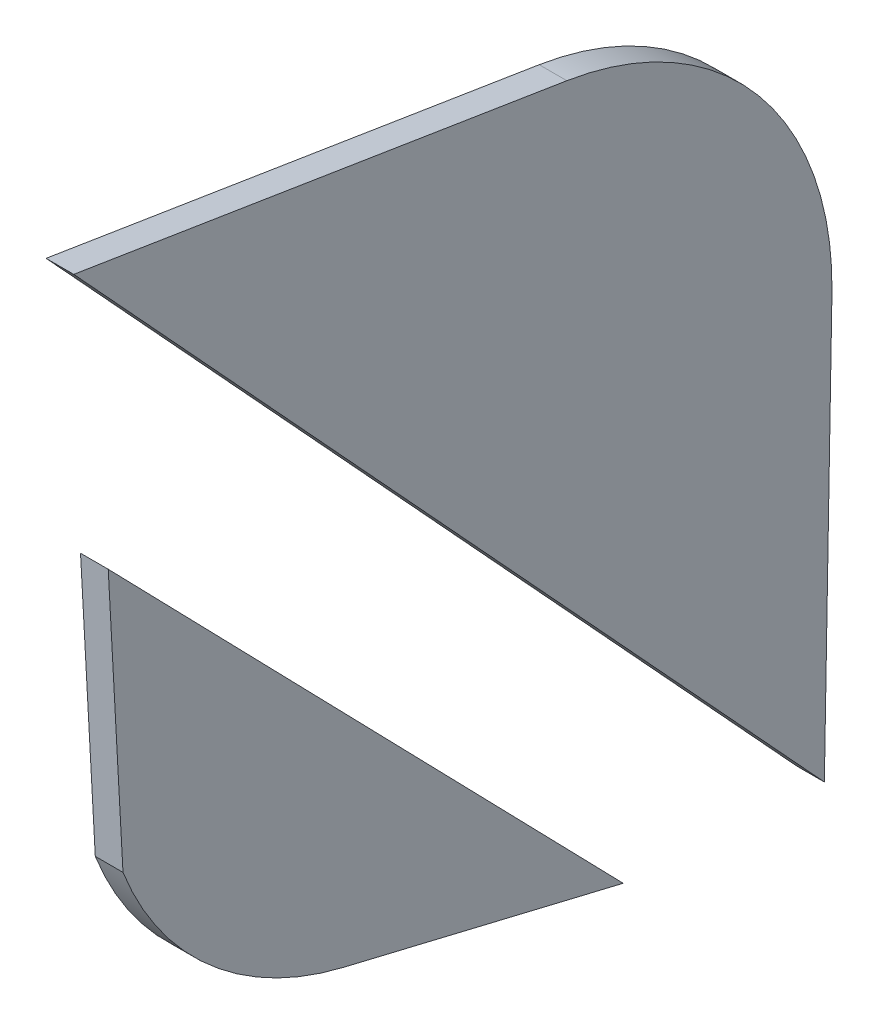
ISO-10303-21;
HEADER;
FILE_DESCRIPTION(('STEP AP214'),'2;1');
FILE_NAME('part.step','',(''),(''),'','','');
FILE_SCHEMA(('AUTOMOTIVE_DESIGN { 1 0 10303 214 1 1 1 1 }'));
ENDSEC;
DATA;
#1=APPLICATION_CONTEXT('core data for automotive mechanical design processes');
#2=APPLICATION_PROTOCOL_DEFINITION('international standard','automotive_design',2000,#1);
#3=PRODUCT_CONTEXT('',#1,'mechanical');
#4=PRODUCT('Part','Part','',(#3));
#5=PRODUCT_RELATED_PRODUCT_CATEGORY('part','',(#4));
#6=PRODUCT_DEFINITION_FORMATION('','',#4);
#7=PRODUCT_DEFINITION_CONTEXT('part definition',#1,'design');
#8=PRODUCT_DEFINITION('design','',#6,#7);
#9=PRODUCT_DEFINITION_SHAPE('','',#8);
#10=(LENGTH_UNIT() NAMED_UNIT(*) SI_UNIT(.MILLI.,.METRE.));
#11=(NAMED_UNIT(*) PLANE_ANGLE_UNIT() SI_UNIT($,.RADIAN.));
#12=(NAMED_UNIT(*) SI_UNIT($,.STERADIAN.) SOLID_ANGLE_UNIT());
#13=UNCERTAINTY_MEASURE_WITH_UNIT(LENGTH_MEASURE(1.E-05),#10,'distance_accuracy_value','');
#14=(GEOMETRIC_REPRESENTATION_CONTEXT(3) GLOBAL_UNCERTAINTY_ASSIGNED_CONTEXT((#13)) GLOBAL_UNIT_ASSIGNED_CONTEXT((#10,
#11,#12)) REPRESENTATION_CONTEXT('',''));
#15=CARTESIAN_POINT('',(0.,0.,0.));
#16=DIRECTION('',(0.,0.,1.));
#17=DIRECTION('',(1.,0.,0.));
#18=AXIS2_PLACEMENT_3D('',#15,#16,#17);
#19=CARTESIAN_POINT('',(3.,30.4101255650736,1.66494493144792));
#20=DIRECTION('',(-1.,0.,0.));
#21=DIRECTION('',(0.,0.,1.));
#22=AXIS2_PLACEMENT_3D('',#19,#20,#21);
#23=CYLINDRICAL_SURFACE('',#22,34.0995000000001);
#24=CARTESIAN_POINT('',(0.,30.4101255650736,1.66494493144792));
#25=DIRECTION('',(1.,0.,0.));
#26=DIRECTION('',(0.,0.,-1.));
#27=AXIS2_PLACEMENT_3D('',#24,#25,#26);
#28=CIRCLE('',#27,34.0995000000001);
#29=CARTESIAN_POINT('',(0.,18.0941682146981,33.4626350172661));
#30=VERTEX_POINT('',#29);
#31=CARTESIAN_POINT('',(0.,-2.74986062470444,9.61423522327529));
#32=VERTEX_POINT('',#31);
#33=EDGE_CURVE('E106',#30,#32,#28,.T.);
#34=ORIENTED_EDGE('',*,*,#33,.T.);
#35=DIRECTION('',(-1.,0.,0.));
#36=VECTOR('',#35,1.);
#37=CARTESIAN_POINT('',(3.,-2.74986062470444,9.61423522327529));
#38=LINE('',#37,#36);
#39=CARTESIAN_POINT('',(3.,-2.74986062470444,9.61423522327529));
#40=VERTEX_POINT('',#39);
#41=EDGE_CURVE('E12',#40,#32,#38,.T.);
#42=ORIENTED_EDGE('',*,*,#41,.F.);
#43=CARTESIAN_POINT('',(3.,30.4101255650736,1.66494493144792));
#44=DIRECTION('',(1.,0.,0.));
#45=DIRECTION('',(0.,0.,-1.));
#46=AXIS2_PLACEMENT_3D('',#43,#44,#45);
#47=CIRCLE('',#46,34.0995000000001);
#48=CARTESIAN_POINT('',(3.,18.0941682146981,33.4626350172661));
#49=VERTEX_POINT('',#48);
#50=EDGE_CURVE('E94',#49,#40,#47,.T.);
#51=ORIENTED_EDGE('',*,*,#50,.F.);
#52=DIRECTION('',(-1.,0.,0.));
#53=VECTOR('',#52,1.);
#54=CARTESIAN_POINT('',(3.,18.0941682146981,33.4626350172661));
#55=LINE('',#54,#53);
#56=EDGE_CURVE('E102',#49,#30,#55,.T.);
#57=ORIENTED_EDGE('',*,*,#56,.T.);
#58=EDGE_LOOP('',(#34,#42,#51,#57));
#59=FACE_BOUND('',#58,.T.);
#60=ADVANCED_FACE('F43',(#59),#23,.T.);
#61=CARTESIAN_POINT('',(3.,-10.0206702003246,-20.7155094790845));
#62=DIRECTION('',(0.,0.972447871369899,-0.233120435543845));
#63=DIRECTION('',(0.,0.233120435543845,0.972447871369899));
#64=AXIS2_PLACEMENT_3D('',#61,#62,#63);
#65=PLANE('',#64);
#66=DIRECTION('',(0.,-0.233120435543845,-0.972447871369899));
#67=VECTOR('',#66,1.);
#68=CARTESIAN_POINT('',(0.,-10.0206702003246,-20.7155094790845));
#69=LINE('',#68,#67);
#70=CARTESIAN_POINT('',(0.,-10.0206702003246,-20.7155094790845));
#71=VERTEX_POINT('',#70);
#72=EDGE_CURVE('E98',#32,#71,#69,.T.);
#73=ORIENTED_EDGE('',*,*,#72,.T.);
#74=DIRECTION('',(-1.,0.,0.));
#75=VECTOR('',#74,1.);
#76=CARTESIAN_POINT('',(3.,-10.0206702003246,-20.7155094790845));
#77=LINE('',#76,#75);
#78=CARTESIAN_POINT('',(3.,-10.0206702003246,-20.7155094790845));
#79=VERTEX_POINT('',#78);
#80=EDGE_CURVE('E51',#79,#71,#77,.T.);
#81=ORIENTED_EDGE('',*,*,#80,.F.);
#82=DIRECTION('',(0.,-0.233120435543845,-0.972447871369899));
#83=VECTOR('',#82,1.);
#84=CARTESIAN_POINT('',(3.,-10.0206702003246,-20.7155094790845));
#85=LINE('',#84,#83);
#86=EDGE_CURVE('E89',#40,#79,#85,.T.);
#87=ORIENTED_EDGE('',*,*,#86,.F.);
#88=ORIENTED_EDGE('',*,*,#41,.T.);
#89=EDGE_LOOP('',(#73,#81,#87,#88));
#90=FACE_BOUND('',#89,.T.);
#91=ADVANCED_FACE('F97',(#90),#65,.F.);
#92=CARTESIAN_POINT('',(3.,47.3277765822479,35.0622248924949));
#93=DIRECTION('',(0.,-0.697221679644741,0.716855584782155));
#94=DIRECTION('',(0.,-0.716855584782155,-0.697221679644741));
#95=AXIS2_PLACEMENT_3D('',#92,#93,#94);
#96=PLANE('',#95);
#97=DIRECTION('',(0.,0.716855584782155,0.697221679644741));
#98=VECTOR('',#97,1.);
#99=CARTESIAN_POINT('',(0.,47.3277765822479,35.0622248924949));
#100=LINE('',#99,#98);
#101=CARTESIAN_POINT('',(0.,47.3277765822479,35.0622248924949));
#102=VERTEX_POINT('',#101);
#103=EDGE_CURVE('E76',#71,#102,#100,.T.);
#104=ORIENTED_EDGE('',*,*,#103,.T.);
#105=DIRECTION('',(-1.,0.,0.));
#106=VECTOR('',#105,1.);
#107=CARTESIAN_POINT('',(3.,47.3277765822479,35.0622248924949));
#108=LINE('',#107,#106);
#109=CARTESIAN_POINT('',(3.,47.3277765822479,35.0622248924949));
#110=VERTEX_POINT('',#109);
#111=EDGE_CURVE('E99',#110,#102,#108,.T.);
#112=ORIENTED_EDGE('',*,*,#111,.F.);
#113=DIRECTION('',(0.,0.716855584782155,0.697221679644741));
#114=VECTOR('',#113,1.);
#115=CARTESIAN_POINT('',(3.,47.3277765822479,35.0622248924949));
#116=LINE('',#115,#114);
#117=EDGE_CURVE('E92',#79,#110,#116,.T.);
#118=ORIENTED_EDGE('',*,*,#117,.F.);
#119=ORIENTED_EDGE('',*,*,#80,.T.);
#120=EDGE_LOOP('',(#104,#112,#118,#119));
#121=FACE_BOUND('',#120,.T.);
#122=ADVANCED_FACE('F100',(#121),#96,.F.);
#123=CARTESIAN_POINT('',(3.,18.0941682146981,33.4626350172661));
#124=DIRECTION('',(0.,0.0546357681614191,-0.998506350924926));
#125=DIRECTION('',(0.,0.998506350924926,0.0546357681614191));
#126=AXIS2_PLACEMENT_3D('',#123,#124,#125);
#127=PLANE('',#126);
#128=DIRECTION('',(0.,-0.998506350924926,-0.0546357681614191));
#129=VECTOR('',#128,1.);
#130=CARTESIAN_POINT('',(0.,18.0941682146981,33.4626350172661));
#131=LINE('',#130,#129);
#132=EDGE_CURVE('E82',#102,#30,#131,.T.);
#133=ORIENTED_EDGE('',*,*,#132,.T.);
#134=ORIENTED_EDGE('',*,*,#56,.F.);
#135=DIRECTION('',(0.,-0.998506350924926,-0.0546357681614191));
#136=VECTOR('',#135,1.);
#137=CARTESIAN_POINT('',(3.,18.0941682146981,33.4626350172661));
#138=LINE('',#137,#136);
#139=EDGE_CURVE('E59',#110,#49,#138,.T.);
#140=ORIENTED_EDGE('',*,*,#139,.F.);
#141=ORIENTED_EDGE('',*,*,#111,.T.);
#142=EDGE_LOOP('',(#133,#134,#140,#141));
#143=FACE_BOUND('',#142,.T.);
#144=ADVANCED_FACE('F113',(#143),#127,.F.);
#145=CARTESIAN_POINT('',(3.,30.4101255650736,1.66494493144792));
#146=DIRECTION('',(1.,0.,0.));
#147=DIRECTION('',(0.,0.,-1.));
#148=AXIS2_PLACEMENT_3D('',#145,#146,#147);
#149=PLANE('',#148);
#150=ORIENTED_EDGE('',*,*,#50,.T.);
#151=ORIENTED_EDGE('',*,*,#86,.T.);
#152=ORIENTED_EDGE('',*,*,#117,.T.);
#153=ORIENTED_EDGE('',*,*,#139,.T.);
#154=EDGE_LOOP('',(#150,#151,#152,#153));
#155=FACE_BOUND('',#154,.T.);
#156=ADVANCED_FACE('F90',(#155),#149,.T.);
#157=CARTESIAN_POINT('',(0.,30.4101255650736,1.66494493144792));
#158=DIRECTION('',(1.,0.,0.));
#159=DIRECTION('',(0.,0.,-1.));
#160=AXIS2_PLACEMENT_3D('',#157,#158,#159);
#161=PLANE('',#160);
#162=ORIENTED_EDGE('',*,*,#33,.F.);
#163=ORIENTED_EDGE('',*,*,#132,.F.);
#164=ORIENTED_EDGE('',*,*,#103,.F.);
#165=ORIENTED_EDGE('',*,*,#72,.F.);
#166=EDGE_LOOP('',(#162,#163,#164,#165));
#167=FACE_BOUND('',#166,.T.);
#168=ADVANCED_FACE('F116',(#167),#161,.F.);
#169=CLOSED_SHELL('',(#60,#91,#122,#144,#156,#168));
#170=MANIFOLD_SOLID_BREP('B2',#169);
#171=CARTESIAN_POINT('',(3.,34.6409623931376,-9.22864738070533));
#172=DIRECTION('',(-1.,0.,0.));
#173=DIRECTION('',(0.,0.,1.));
#174=AXIS2_PLACEMENT_3D('',#171,#172,#173);
#175=CYLINDRICAL_SURFACE('',#174,34.0995);
#176=CARTESIAN_POINT('',(0.,34.6409623931376,-9.22864738070533));
#177=DIRECTION('',(1.,0.,0.));
#178=DIRECTION('',(0.,0.,-1.));
#179=AXIS2_PLACEMENT_3D('',#176,#177,#178);
#180=CIRCLE('',#179,34.0995);
#181=CARTESIAN_POINT('',(0.,34.0247493256674,-43.3225791238394));
#182=VERTEX_POINT('',#181);
#183=CARTESIAN_POINT('',(0.,68.3127892515936,-14.6123242157469));
#184=VERTEX_POINT('',#183);
#185=EDGE_CURVE('E230',#182,#184,#180,.T.);
#186=ORIENTED_EDGE('',*,*,#185,.T.);
#187=DIRECTION('',(-1.,0.,0.));
#188=VECTOR('',#187,1.);
#189=CARTESIAN_POINT('',(3.,68.3127892515936,-14.6123242157469));
#190=LINE('',#189,#188);
#191=CARTESIAN_POINT('',(3.,68.3127892515936,-14.6123242157469));
#192=VERTEX_POINT('',#191);
#193=EDGE_CURVE('E41',#192,#184,#190,.T.);
#194=ORIENTED_EDGE('',*,*,#193,.F.);
#195=CARTESIAN_POINT('',(3.,34.6409623931376,-9.22864738070533));
#196=DIRECTION('',(1.,0.,0.));
#197=DIRECTION('',(0.,0.,-1.));
#198=AXIS2_PLACEMENT_3D('',#195,#196,#197);
#199=CIRCLE('',#198,34.0995);
#200=CARTESIAN_POINT('',(3.,34.0247493256674,-43.3225791238394));
#201=VERTEX_POINT('',#200);
#202=EDGE_CURVE('E218',#201,#192,#199,.T.);
#203=ORIENTED_EDGE('',*,*,#202,.F.);
#204=DIRECTION('',(-1.,0.,0.));
#205=VECTOR('',#204,1.);
#206=CARTESIAN_POINT('',(3.,34.0247493256674,-43.3225791238394));
#207=LINE('',#206,#205);
#208=EDGE_CURVE('E226',#201,#182,#207,.T.);
#209=ORIENTED_EDGE('',*,*,#208,.T.);
#210=EDGE_LOOP('',(#186,#194,#203,#209));
#211=FACE_BOUND('',#210,.T.);
#212=ADVANCED_FACE('F167',(#211),#175,.T.);
#213=CARTESIAN_POINT('',(3.,76.8519257017764,38.7951021364083));
#214=DIRECTION('',(0.,-0.987458081744776,0.157881401048154));
#215=DIRECTION('',(0.,-0.157881401048154,-0.987458081744776));
#216=AXIS2_PLACEMENT_3D('',#213,#214,#215);
#217=PLANE('',#216);
#218=DIRECTION('',(0.,0.157881401048154,0.987458081744776));
#219=VECTOR('',#218,1.);
#220=CARTESIAN_POINT('',(0.,76.8519257017764,38.7951021364083));
#221=LINE('',#220,#219);
#222=CARTESIAN_POINT('',(0.,76.8519257017764,38.7951021364083));
#223=VERTEX_POINT('',#222);
#224=EDGE_CURVE('E222',#184,#223,#221,.T.);
#225=ORIENTED_EDGE('',*,*,#224,.T.);
#226=DIRECTION('',(-1.,0.,0.));
#227=VECTOR('',#226,1.);
#228=CARTESIAN_POINT('',(3.,76.8519257017764,38.7951021364083));
#229=LINE('',#228,#227);
#230=CARTESIAN_POINT('',(3.,76.8519257017764,38.7951021364083));
#231=VERTEX_POINT('',#230);
#232=EDGE_CURVE('E175',#231,#223,#229,.T.);
#233=ORIENTED_EDGE('',*,*,#232,.F.);
#234=DIRECTION('',(0.,0.157881401048154,0.987458081744776));
#235=VECTOR('',#234,1.);
#236=CARTESIAN_POINT('',(3.,76.8519257017764,38.7951021364083));
#237=LINE('',#236,#235);
#238=EDGE_CURVE('E213',#192,#231,#237,.T.);
#239=ORIENTED_EDGE('',*,*,#238,.F.);
#240=ORIENTED_EDGE('',*,*,#193,.T.);
#241=EDGE_LOOP('',(#225,#233,#239,#240));
#242=FACE_BOUND('',#241,.T.);
#243=ADVANCED_FACE('F221',(#242),#217,.F.);
#244=CARTESIAN_POINT('',(3.,76.8519257017764,38.7951021364083));
#245=DIRECTION('',(0.,0.677470169108869,-0.735550249790999));
#246=DIRECTION('',(0.,0.735550249790999,0.677470169108869));
#247=AXIS2_PLACEMENT_3D('',#244,#245,#246);
#248=PLANE('',#247);
#249=DIRECTION('',(0.,-0.735550249790999,-0.677470169108869));
#250=VECTOR('',#249,1.);
#251=CARTESIAN_POINT('',(0.,76.8519257017764,38.7951021364083));
#252=LINE('',#251,#250);
#253=CARTESIAN_POINT('',(0.,-11.4141042731435,-42.5013181566559));
#254=VERTEX_POINT('',#253);
#255=EDGE_CURVE('E200',#223,#254,#252,.T.);
#256=ORIENTED_EDGE('',*,*,#255,.T.);
#257=DIRECTION('',(-1.,0.,0.));
#258=VECTOR('',#257,1.);
#259=CARTESIAN_POINT('',(3.,-11.4141042731435,-42.5013181566559));
#260=LINE('',#259,#258);
#261=CARTESIAN_POINT('',(3.,-11.4141042731435,-42.5013181566559));
#262=VERTEX_POINT('',#261);
#263=EDGE_CURVE('E223',#262,#254,#260,.T.);
#264=ORIENTED_EDGE('',*,*,#263,.F.);
#265=DIRECTION('',(0.,-0.735550249790999,-0.677470169108869));
#266=VECTOR('',#265,1.);
#267=CARTESIAN_POINT('',(3.,76.8519257017764,38.7951021364083));
#268=LINE('',#267,#266);
#269=EDGE_CURVE('E216',#231,#262,#268,.T.);
#270=ORIENTED_EDGE('',*,*,#269,.F.);
#271=ORIENTED_EDGE('',*,*,#232,.T.);
#272=EDGE_LOOP('',(#256,#264,#270,#271));
#273=FACE_BOUND('',#272,.T.);
#274=ADVANCED_FACE('F224',(#273),#248,.F.);
#275=CARTESIAN_POINT('',(3.,34.0247493256674,-43.3225791238394));
#276=DIRECTION('',(0.,0.0180710294130463,0.999836705615448));
#277=DIRECTION('',(0.,-0.999836705615448,0.0180710294130463));
#278=AXIS2_PLACEMENT_3D('',#275,#276,#277);
#279=PLANE('',#278);
#280=DIRECTION('',(0.,0.999836705615448,-0.0180710294130463));
#281=VECTOR('',#280,1.);
#282=CARTESIAN_POINT('',(0.,34.0247493256674,-43.3225791238394));
#283=LINE('',#282,#281);
#284=EDGE_CURVE('E206',#254,#182,#283,.T.);
#285=ORIENTED_EDGE('',*,*,#284,.T.);
#286=ORIENTED_EDGE('',*,*,#208,.F.);
#287=DIRECTION('',(0.,0.999836705615448,-0.0180710294130463));
#288=VECTOR('',#287,1.);
#289=CARTESIAN_POINT('',(3.,34.0247493256674,-43.3225791238394));
#290=LINE('',#289,#288);
#291=EDGE_CURVE('E183',#262,#201,#290,.T.);
#292=ORIENTED_EDGE('',*,*,#291,.F.);
#293=ORIENTED_EDGE('',*,*,#263,.T.);
#294=EDGE_LOOP('',(#285,#286,#292,#293));
#295=FACE_BOUND('',#294,.T.);
#296=ADVANCED_FACE('F237',(#295),#279,.F.);
#297=CARTESIAN_POINT('',(3.,34.6409623931376,-9.22864738070533));
#298=DIRECTION('',(1.,0.,0.));
#299=DIRECTION('',(0.,0.,-1.));
#300=AXIS2_PLACEMENT_3D('',#297,#298,#299);
#301=PLANE('',#300);
#302=ORIENTED_EDGE('',*,*,#202,.T.);
#303=ORIENTED_EDGE('',*,*,#238,.T.);
#304=ORIENTED_EDGE('',*,*,#269,.T.);
#305=ORIENTED_EDGE('',*,*,#291,.T.);
#306=EDGE_LOOP('',(#302,#303,#304,#305));
#307=FACE_BOUND('',#306,.T.);
#308=ADVANCED_FACE('F214',(#307),#301,.T.);
#309=CARTESIAN_POINT('',(0.,34.6409623931376,-9.22864738070533));
#310=DIRECTION('',(1.,0.,0.));
#311=DIRECTION('',(0.,0.,-1.));
#312=AXIS2_PLACEMENT_3D('',#309,#310,#311);
#313=PLANE('',#312);
#314=ORIENTED_EDGE('',*,*,#185,.F.);
#315=ORIENTED_EDGE('',*,*,#284,.F.);
#316=ORIENTED_EDGE('',*,*,#255,.F.);
#317=ORIENTED_EDGE('',*,*,#224,.F.);
#318=EDGE_LOOP('',(#314,#315,#316,#317));
#319=FACE_BOUND('',#318,.T.);
#320=ADVANCED_FACE('F240',(#319),#313,.F.);
#321=CLOSED_SHELL('',(#212,#243,#274,#296,#308,#320));
#322=MANIFOLD_SOLID_BREP('B6',#321);
#323=ADVANCED_BREP_SHAPE_REPRESENTATION('',(#18,#170,#322),#14);
#324=SHAPE_DEFINITION_REPRESENTATION(#9,#323);
ENDSEC;
END-ISO-10303-21;
